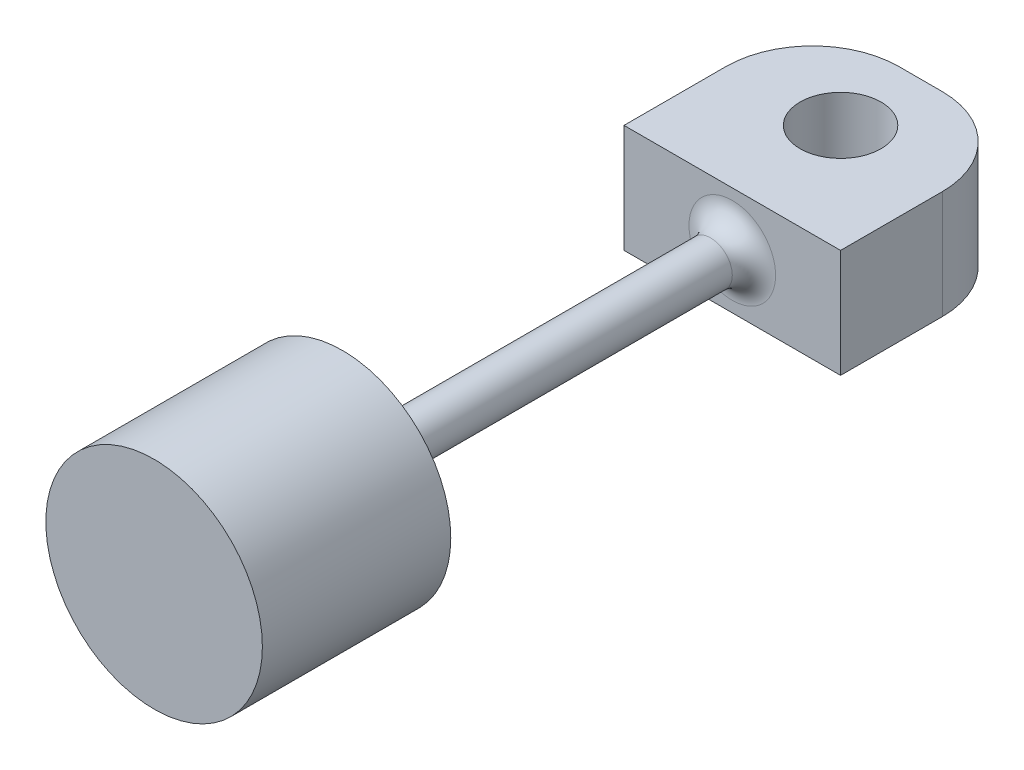
ISO-10303-21;
HEADER;
FILE_DESCRIPTION(('STEP AP214'),'2;1');
FILE_NAME('part.step','',(''),(''),'','','');
FILE_SCHEMA(('AUTOMOTIVE_DESIGN { 1 0 10303 214 1 1 1 1 }'));
ENDSEC;
DATA;
#1=APPLICATION_CONTEXT('core data for automotive mechanical design processes');
#2=APPLICATION_PROTOCOL_DEFINITION('international standard','automotive_design',2000,#1);
#3=PRODUCT_CONTEXT('',#1,'mechanical');
#4=PRODUCT('Part','Part','',(#3));
#5=PRODUCT_RELATED_PRODUCT_CATEGORY('part','',(#4));
#6=PRODUCT_DEFINITION_FORMATION('','',#4);
#7=PRODUCT_DEFINITION_CONTEXT('part definition',#1,'design');
#8=PRODUCT_DEFINITION('design','',#6,#7);
#9=PRODUCT_DEFINITION_SHAPE('','',#8);
#10=(LENGTH_UNIT() NAMED_UNIT(*) SI_UNIT(.MILLI.,.METRE.));
#11=(NAMED_UNIT(*) PLANE_ANGLE_UNIT() SI_UNIT($,.RADIAN.));
#12=(NAMED_UNIT(*) SI_UNIT($,.STERADIAN.) SOLID_ANGLE_UNIT());
#13=UNCERTAINTY_MEASURE_WITH_UNIT(LENGTH_MEASURE(1.E-05),#10,'distance_accuracy_value','');
#14=(GEOMETRIC_REPRESENTATION_CONTEXT(3) GLOBAL_UNCERTAINTY_ASSIGNED_CONTEXT((#13)) GLOBAL_UNIT_ASSIGNED_CONTEXT((#10,
#11,#12)) REPRESENTATION_CONTEXT('',''));
#15=CARTESIAN_POINT('',(0.,0.,0.));
#16=DIRECTION('',(0.,0.,1.));
#17=DIRECTION('',(1.,0.,0.));
#18=AXIS2_PLACEMENT_3D('',#15,#16,#17);
#19=CARTESIAN_POINT('',(0.,0.,-11.049));
#20=DIRECTION('',(0.,0.,1.));
#21=DIRECTION('',(1.,0.,0.));
#22=AXIS2_PLACEMENT_3D('',#19,#20,#21);
#23=CYLINDRICAL_SURFACE('',#22,6.35);
#24=CARTESIAN_POINT('',(0.,0.,-11.049));
#25=DIRECTION('',(0.,0.,1.));
#26=DIRECTION('',(1.,0.,0.));
#27=AXIS2_PLACEMENT_3D('',#24,#25,#26);
#28=CIRCLE('',#27,6.35);
#29=CARTESIAN_POINT('',(6.35,0.,-11.049));
#30=VERTEX_POINT('',#29);
#31=EDGE_CURVE('E143',#30,#30,#28,.T.);
#32=ORIENTED_EDGE('',*,*,#31,.T.);
#33=EDGE_LOOP('',(#32));
#34=FACE_BOUND('',#33,.T.);
#35=CARTESIAN_POINT('',(0.,0.,0.));
#36=DIRECTION('',(0.,0.,1.));
#37=DIRECTION('',(1.,0.,0.));
#38=AXIS2_PLACEMENT_3D('',#35,#36,#37);
#39=CIRCLE('',#38,6.35);
#40=CARTESIAN_POINT('',(6.35,0.,0.));
#41=VERTEX_POINT('',#40);
#42=EDGE_CURVE('E103',#41,#41,#39,.T.);
#43=ORIENTED_EDGE('',*,*,#42,.F.);
#44=EDGE_LOOP('',(#43));
#45=FACE_BOUND('',#44,.T.);
#46=ADVANCED_FACE('F42',(#34,#45),#23,.T.);
#47=CARTESIAN_POINT('',(0.,0.,-11.049));
#48=DIRECTION('',(0.,0.,1.));
#49=DIRECTION('',(1.,0.,0.));
#50=AXIS2_PLACEMENT_3D('',#47,#48,#49);
#51=PLANE('',#50);
#52=CARTESIAN_POINT('',(0.,0.,-11.049));
#53=DIRECTION('',(0.,0.,1.));
#54=DIRECTION('',(1.,0.,0.));
#55=AXIS2_PLACEMENT_3D('',#52,#53,#54);
#56=CIRCLE('',#55,2.54);
#57=CARTESIAN_POINT('',(2.54,0.,-11.049));
#58=VERTEX_POINT('',#57);
#59=EDGE_CURVE('E154',#58,#58,#56,.T.);
#60=ORIENTED_EDGE('',*,*,#59,.T.);
#61=EDGE_LOOP('',(#60));
#62=FACE_BOUND('',#61,.T.);
#63=ORIENTED_EDGE('',*,*,#31,.F.);
#64=EDGE_LOOP('',(#63));
#65=FACE_BOUND('',#64,.T.);
#66=ADVANCED_FACE('F210',(#62,#65),#51,.F.);
#67=CARTESIAN_POINT('',(0.,0.,0.));
#68=DIRECTION('',(0.,0.,1.));
#69=DIRECTION('',(1.,0.,0.));
#70=AXIS2_PLACEMENT_3D('',#67,#68,#69);
#71=PLANE('',#70);
#72=ORIENTED_EDGE('',*,*,#42,.T.);
#73=EDGE_LOOP('',(#72));
#74=FACE_BOUND('',#73,.T.);
#75=ADVANCED_FACE('F216',(#74),#71,.T.);
#76=CARTESIAN_POINT('',(0.,0.,-33.909));
#77=DIRECTION('',(0.,0.,1.));
#78=DIRECTION('',(1.,0.,0.));
#79=AXIS2_PLACEMENT_3D('',#76,#77,#78);
#80=CYLINDRICAL_SURFACE('',#79,1.27);
#81=CARTESIAN_POINT('',(0.,0.,-32.639));
#82=DIRECTION('',(0.,0.,-1.));
#83=DIRECTION('',(-1.,0.,0.));
#84=AXIS2_PLACEMENT_3D('',#81,#82,#83);
#85=CIRCLE('',#84,1.27);
#86=CARTESIAN_POINT('',(-1.27,0.,-32.639));
#87=VERTEX_POINT('',#86);
#88=EDGE_CURVE('E162',#87,#87,#85,.F.);
#89=ORIENTED_EDGE('',*,*,#88,.T.);
#90=EDGE_LOOP('',(#89));
#91=FACE_BOUND('',#90,.T.);
#92=CARTESIAN_POINT('',(0.,0.,-12.319));
#93=DIRECTION('',(0.,0.,1.));
#94=DIRECTION('',(1.,0.,0.));
#95=AXIS2_PLACEMENT_3D('',#92,#93,#94);
#96=CIRCLE('',#95,1.27);
#97=CARTESIAN_POINT('',(1.27,0.,-12.319));
#98=VERTEX_POINT('',#97);
#99=EDGE_CURVE('E147',#98,#98,#96,.F.);
#100=ORIENTED_EDGE('',*,*,#99,.T.);
#101=EDGE_LOOP('',(#100));
#102=FACE_BOUND('',#101,.T.);
#103=ADVANCED_FACE('F225',(#91,#102),#80,.T.);
#104=CARTESIAN_POINT('',(0.,0.,-12.319));
#105=DIRECTION('',(0.,0.,1.));
#106=DIRECTION('',(1.,0.,0.));
#107=AXIS2_PLACEMENT_3D('',#104,#105,#106);
#108=TOROIDAL_SURFACE('',#107,2.54,1.27);
#109=ORIENTED_EDGE('',*,*,#59,.F.);
#110=EDGE_LOOP('',(#109));
#111=FACE_BOUND('',#110,.T.);
#112=ORIENTED_EDGE('',*,*,#99,.F.);
#113=EDGE_LOOP('',(#112));
#114=FACE_BOUND('',#113,.T.);
#115=ADVANCED_FACE('F222',(#111,#114),#108,.F.);
#116=CARTESIAN_POINT('',(6.35,-3.175,-44.958));
#117=DIRECTION('',(-1.,0.,0.));
#118=DIRECTION('',(0.,0.,1.));
#119=AXIS2_PLACEMENT_3D('',#116,#117,#118);
#120=PLANE('',#119);
#121=DIRECTION('',(0.,0.,1.));
#122=VECTOR('',#121,1.);
#123=CARTESIAN_POINT('',(6.35,-3.175,-44.958));
#124=LINE('',#123,#122);
#125=CARTESIAN_POINT('',(6.35,-3.175,-39.878));
#126=VERTEX_POINT('',#125);
#127=CARTESIAN_POINT('',(6.35,-3.175,-33.909));
#128=VERTEX_POINT('',#127);
#129=EDGE_CURVE('E94',#126,#128,#124,.T.);
#130=ORIENTED_EDGE('',*,*,#129,.F.);
#131=DIRECTION('',(0.,-1.,0.));
#132=VECTOR('',#131,1.);
#133=CARTESIAN_POINT('',(6.35,3.175,-39.878));
#134=LINE('',#133,#132);
#135=CARTESIAN_POINT('',(6.35,3.175,-39.878));
#136=VERTEX_POINT('',#135);
#137=EDGE_CURVE('E11',#126,#136,#134,.F.);
#138=ORIENTED_EDGE('',*,*,#137,.T.);
#139=DIRECTION('',(0.,0.,1.));
#140=VECTOR('',#139,1.);
#141=CARTESIAN_POINT('',(6.35,3.175,-44.958));
#142=LINE('',#141,#140);
#143=CARTESIAN_POINT('',(6.35,3.175,-33.909));
#144=VERTEX_POINT('',#143);
#145=EDGE_CURVE('E117',#136,#144,#142,.T.);
#146=ORIENTED_EDGE('',*,*,#145,.T.);
#147=DIRECTION('',(0.,-1.,0.));
#148=VECTOR('',#147,1.);
#149=CARTESIAN_POINT('',(6.35,-3.175,-33.909));
#150=LINE('',#149,#148);
#151=EDGE_CURVE('E110',#144,#128,#150,.T.);
#152=ORIENTED_EDGE('',*,*,#151,.T.);
#153=EDGE_LOOP('',(#130,#138,#146,#152));
#154=FACE_BOUND('',#153,.T.);
#155=ADVANCED_FACE('F115',(#154),#120,.F.);
#156=CARTESIAN_POINT('',(-6.35,-3.175,-44.958));
#157=DIRECTION('',(0.,1.,0.));
#158=DIRECTION('',(-1.,0.,0.));
#159=AXIS2_PLACEMENT_3D('',#156,#157,#158);
#160=PLANE('',#159);
#161=CARTESIAN_POINT('',(0.,-3.175,-40.259));
#162=DIRECTION('',(0.,1.,0.));
#163=DIRECTION('',(-1.,0.,0.));
#164=AXIS2_PLACEMENT_3D('',#161,#162,#163);
#165=CIRCLE('',#164,2.3749);
#166=CARTESIAN_POINT('',(-2.3749,-3.175,-40.259));
#167=VERTEX_POINT('',#166);
#168=EDGE_CURVE('E120',#167,#167,#165,.T.);
#169=ORIENTED_EDGE('',*,*,#168,.T.);
#170=EDGE_LOOP('',(#169));
#171=FACE_BOUND('',#170,.T.);
#172=DIRECTION('',(0.,0.,1.));
#173=VECTOR('',#172,1.);
#174=CARTESIAN_POINT('',(-6.35,-3.175,-44.958));
#175=LINE('',#174,#173);
#176=CARTESIAN_POINT('',(-6.35,-3.175,-39.878));
#177=VERTEX_POINT('',#176);
#178=CARTESIAN_POINT('',(-6.35,-3.175,-33.909));
#179=VERTEX_POINT('',#178);
#180=EDGE_CURVE('E104',#177,#179,#175,.T.);
#181=ORIENTED_EDGE('',*,*,#180,.F.);
#182=CARTESIAN_POINT('',(-1.27,-3.175,-39.878));
#183=DIRECTION('',(0.,1.,0.));
#184=DIRECTION('',(-1.,0.,0.));
#185=AXIS2_PLACEMENT_3D('',#182,#183,#184);
#186=CIRCLE('',#185,5.08);
#187=CARTESIAN_POINT('',(-1.27,-3.175,-44.958));
#188=VERTEX_POINT('',#187);
#189=EDGE_CURVE('E51',#177,#188,#186,.F.);
#190=ORIENTED_EDGE('',*,*,#189,.T.);
#191=DIRECTION('',(-1.,0.,0.));
#192=VECTOR('',#191,1.);
#193=CARTESIAN_POINT('',(-6.35,-3.175,-44.958));
#194=LINE('',#193,#192);
#195=CARTESIAN_POINT('',(1.27,-3.175,-44.958));
#196=VERTEX_POINT('',#195);
#197=EDGE_CURVE('E135',#196,#188,#194,.T.);
#198=ORIENTED_EDGE('',*,*,#197,.F.);
#199=CARTESIAN_POINT('',(1.27,-3.175,-39.878));
#200=DIRECTION('',(0.,1.,0.));
#201=DIRECTION('',(-1.,0.,0.));
#202=AXIS2_PLACEMENT_3D('',#199,#200,#201);
#203=CIRCLE('',#202,5.08);
#204=EDGE_CURVE('E58',#196,#126,#203,.F.);
#205=ORIENTED_EDGE('',*,*,#204,.T.);
#206=ORIENTED_EDGE('',*,*,#129,.T.);
#207=DIRECTION('',(-1.,0.,0.));
#208=VECTOR('',#207,1.);
#209=CARTESIAN_POINT('',(-6.35,-3.175,-33.909));
#210=LINE('',#209,#208);
#211=EDGE_CURVE('E97',#128,#179,#210,.T.);
#212=ORIENTED_EDGE('',*,*,#211,.T.);
#213=EDGE_LOOP('',(#181,#190,#198,#205,#206,#212));
#214=FACE_BOUND('',#213,.T.);
#215=ADVANCED_FACE('F96',(#171,#214),#160,.F.);
#216=CARTESIAN_POINT('',(-6.35,-3.175,-44.958));
#217=DIRECTION('',(1.,0.,0.));
#218=DIRECTION('',(0.,0.,-1.));
#219=AXIS2_PLACEMENT_3D('',#216,#217,#218);
#220=PLANE('',#219);
#221=DIRECTION('',(0.,0.,1.));
#222=VECTOR('',#221,1.);
#223=CARTESIAN_POINT('',(-6.35,3.175,-44.958));
#224=LINE('',#223,#222);
#225=CARTESIAN_POINT('',(-6.35,3.175,-39.878));
#226=VERTEX_POINT('',#225);
#227=CARTESIAN_POINT('',(-6.35,3.175,-33.909));
#228=VERTEX_POINT('',#227);
#229=EDGE_CURVE('E138',#226,#228,#224,.T.);
#230=ORIENTED_EDGE('',*,*,#229,.F.);
#231=DIRECTION('',(0.,1.,0.));
#232=VECTOR('',#231,1.);
#233=CARTESIAN_POINT('',(-6.35,-3.175,-39.878));
#234=LINE('',#233,#232);
#235=EDGE_CURVE('E66',#226,#177,#234,.F.);
#236=ORIENTED_EDGE('',*,*,#235,.T.);
#237=ORIENTED_EDGE('',*,*,#180,.T.);
#238=DIRECTION('',(0.,1.,0.));
#239=VECTOR('',#238,1.);
#240=CARTESIAN_POINT('',(-6.35,-3.175,-33.909));
#241=LINE('',#240,#239);
#242=EDGE_CURVE('E112',#179,#228,#241,.T.);
#243=ORIENTED_EDGE('',*,*,#242,.T.);
#244=EDGE_LOOP('',(#230,#236,#237,#243));
#245=FACE_BOUND('',#244,.T.);
#246=ADVANCED_FACE('F197',(#245),#220,.F.);
#247=CARTESIAN_POINT('',(-6.35,3.175,-44.958));
#248=DIRECTION('',(0.,-1.,0.));
#249=DIRECTION('',(1.,0.,0.));
#250=AXIS2_PLACEMENT_3D('',#247,#248,#249);
#251=PLANE('',#250);
#252=CARTESIAN_POINT('',(0.,3.175,-40.259));
#253=DIRECTION('',(0.,1.,0.));
#254=DIRECTION('',(-1.,0.,0.));
#255=AXIS2_PLACEMENT_3D('',#252,#253,#254);
#256=CIRCLE('',#255,2.3749);
#257=CARTESIAN_POINT('',(-2.3749,3.175,-40.259));
#258=VERTEX_POINT('',#257);
#259=EDGE_CURVE('E124',#258,#258,#256,.T.);
#260=ORIENTED_EDGE('',*,*,#259,.F.);
#261=EDGE_LOOP('',(#260));
#262=FACE_BOUND('',#261,.T.);
#263=DIRECTION('',(1.,0.,0.));
#264=VECTOR('',#263,1.);
#265=CARTESIAN_POINT('',(-6.35,3.175,-44.958));
#266=LINE('',#265,#264);
#267=CARTESIAN_POINT('',(-1.27,3.175,-44.958));
#268=VERTEX_POINT('',#267);
#269=CARTESIAN_POINT('',(1.27,3.175,-44.958));
#270=VERTEX_POINT('',#269);
#271=EDGE_CURVE('E127',#268,#270,#266,.T.);
#272=ORIENTED_EDGE('',*,*,#271,.F.);
#273=CARTESIAN_POINT('',(-1.27,3.175,-39.878));
#274=DIRECTION('',(0.,-1.,0.));
#275=DIRECTION('',(1.,0.,0.));
#276=AXIS2_PLACEMENT_3D('',#273,#274,#275);
#277=CIRCLE('',#276,5.08);
#278=EDGE_CURVE('E177',#268,#226,#277,.F.);
#279=ORIENTED_EDGE('',*,*,#278,.T.);
#280=ORIENTED_EDGE('',*,*,#229,.T.);
#281=DIRECTION('',(1.,0.,0.));
#282=VECTOR('',#281,1.);
#283=CARTESIAN_POINT('',(-6.35,3.175,-33.909));
#284=LINE('',#283,#282);
#285=EDGE_CURVE('E132',#228,#144,#284,.T.);
#286=ORIENTED_EDGE('',*,*,#285,.T.);
#287=ORIENTED_EDGE('',*,*,#145,.F.);
#288=CARTESIAN_POINT('',(1.27,3.175,-39.878));
#289=DIRECTION('',(0.,-1.,0.));
#290=DIRECTION('',(1.,0.,0.));
#291=AXIS2_PLACEMENT_3D('',#288,#289,#290);
#292=CIRCLE('',#291,5.08);
#293=EDGE_CURVE('E174',#136,#270,#292,.F.);
#294=ORIENTED_EDGE('',*,*,#293,.T.);
#295=EDGE_LOOP('',(#272,#279,#280,#286,#287,#294));
#296=FACE_BOUND('',#295,.T.);
#297=ADVANCED_FACE('F196',(#262,#296),#251,.F.);
#298=CARTESIAN_POINT('',(0.,0.,-44.958));
#299=DIRECTION('',(0.,0.,-1.));
#300=DIRECTION('',(-1.,0.,0.));
#301=AXIS2_PLACEMENT_3D('',#298,#299,#300);
#302=PLANE('',#301);
#303=ORIENTED_EDGE('',*,*,#197,.T.);
#304=DIRECTION('',(0.,1.,0.));
#305=VECTOR('',#304,1.);
#306=CARTESIAN_POINT('',(-1.27,3.175,-44.958));
#307=LINE('',#306,#305);
#308=EDGE_CURVE('E170',#188,#268,#307,.T.);
#309=ORIENTED_EDGE('',*,*,#308,.T.);
#310=ORIENTED_EDGE('',*,*,#271,.T.);
#311=DIRECTION('',(0.,-1.,0.));
#312=VECTOR('',#311,1.);
#313=CARTESIAN_POINT('',(1.27,-3.175,-44.958));
#314=LINE('',#313,#312);
#315=EDGE_CURVE('E166',#270,#196,#314,.T.);
#316=ORIENTED_EDGE('',*,*,#315,.T.);
#317=EDGE_LOOP('',(#303,#309,#310,#316));
#318=FACE_BOUND('',#317,.T.);
#319=ADVANCED_FACE('F189',(#318),#302,.T.);
#320=CARTESIAN_POINT('',(0.,0.,-33.909));
#321=DIRECTION('',(0.,0.,-1.));
#322=DIRECTION('',(-1.,0.,0.));
#323=AXIS2_PLACEMENT_3D('',#320,#321,#322);
#324=PLANE('',#323);
#325=CARTESIAN_POINT('',(0.,0.,-33.909));
#326=DIRECTION('',(0.,0.,-1.));
#327=DIRECTION('',(-1.,0.,0.));
#328=AXIS2_PLACEMENT_3D('',#325,#326,#327);
#329=CIRCLE('',#328,2.54);
#330=CARTESIAN_POINT('',(-2.54,0.,-33.909));
#331=VERTEX_POINT('',#330);
#332=EDGE_CURVE('E158',#331,#331,#329,.T.);
#333=ORIENTED_EDGE('',*,*,#332,.T.);
#334=EDGE_LOOP('',(#333));
#335=FACE_BOUND('',#334,.T.);
#336=ORIENTED_EDGE('',*,*,#151,.F.);
#337=ORIENTED_EDGE('',*,*,#285,.F.);
#338=ORIENTED_EDGE('',*,*,#242,.F.);
#339=ORIENTED_EDGE('',*,*,#211,.F.);
#340=EDGE_LOOP('',(#336,#337,#338,#339));
#341=FACE_BOUND('',#340,.T.);
#342=ADVANCED_FACE('F108',(#335,#341),#324,.F.);
#343=CARTESIAN_POINT('',(0.,0.,-32.639));
#344=DIRECTION('',(0.,0.,-1.));
#345=DIRECTION('',(-1.,0.,0.));
#346=AXIS2_PLACEMENT_3D('',#343,#344,#345);
#347=TOROIDAL_SURFACE('',#346,2.54,1.27);
#348=ORIENTED_EDGE('',*,*,#88,.F.);
#349=EDGE_LOOP('',(#348));
#350=FACE_BOUND('',#349,.T.);
#351=ORIENTED_EDGE('',*,*,#332,.F.);
#352=EDGE_LOOP('',(#351));
#353=FACE_BOUND('',#352,.T.);
#354=ADVANCED_FACE('F208',(#350,#353),#347,.F.);
#355=CARTESIAN_POINT('',(-1.27,0.,-39.878));
#356=DIRECTION('',(0.,-1.,0.));
#357=DIRECTION('',(0.,0.,-1.));
#358=AXIS2_PLACEMENT_3D('',#355,#356,#357);
#359=CYLINDRICAL_SURFACE('',#358,5.08);
#360=ORIENTED_EDGE('',*,*,#189,.F.);
#361=ORIENTED_EDGE('',*,*,#235,.F.);
#362=ORIENTED_EDGE('',*,*,#278,.F.);
#363=ORIENTED_EDGE('',*,*,#308,.F.);
#364=EDGE_LOOP('',(#360,#361,#362,#363));
#365=FACE_BOUND('',#364,.T.);
#366=ADVANCED_FACE('F194',(#365),#359,.T.);
#367=CARTESIAN_POINT('',(1.27,0.,-39.878));
#368=DIRECTION('',(0.,1.,0.));
#369=DIRECTION('',(0.,0.,1.));
#370=AXIS2_PLACEMENT_3D('',#367,#368,#369);
#371=CYLINDRICAL_SURFACE('',#370,5.08);
#372=ORIENTED_EDGE('',*,*,#293,.F.);
#373=ORIENTED_EDGE('',*,*,#137,.F.);
#374=ORIENTED_EDGE('',*,*,#204,.F.);
#375=ORIENTED_EDGE('',*,*,#315,.F.);
#376=EDGE_LOOP('',(#372,#373,#374,#375));
#377=FACE_BOUND('',#376,.T.);
#378=ADVANCED_FACE('F44',(#377),#371,.T.);
#379=CARTESIAN_POINT('',(0.,-6.35,-40.259));
#380=DIRECTION('',(0.,1.,0.));
#381=DIRECTION('',(-1.,0.,0.));
#382=AXIS2_PLACEMENT_3D('',#379,#380,#381);
#383=CYLINDRICAL_SURFACE('',#382,2.3749);
#384=ORIENTED_EDGE('',*,*,#259,.T.);
#385=EDGE_LOOP('',(#384));
#386=FACE_BOUND('',#385,.T.);
#387=ORIENTED_EDGE('',*,*,#168,.F.);
#388=EDGE_LOOP('',(#387));
#389=FACE_BOUND('',#388,.T.);
#390=ADVANCED_FACE('F201',(#386,#389),#383,.F.);
#391=CLOSED_SHELL('',(#46,#66,#75,#103,#115,#155,#215,#246,#297,#319,#342,#354,#366,#378,#390));
#392=MANIFOLD_SOLID_BREP('B2',#391);
#393=ADVANCED_BREP_SHAPE_REPRESENTATION('',(#18,#392),#14);
#394=SHAPE_DEFINITION_REPRESENTATION(#9,#393);
ENDSEC;
END-ISO-10303-21;
